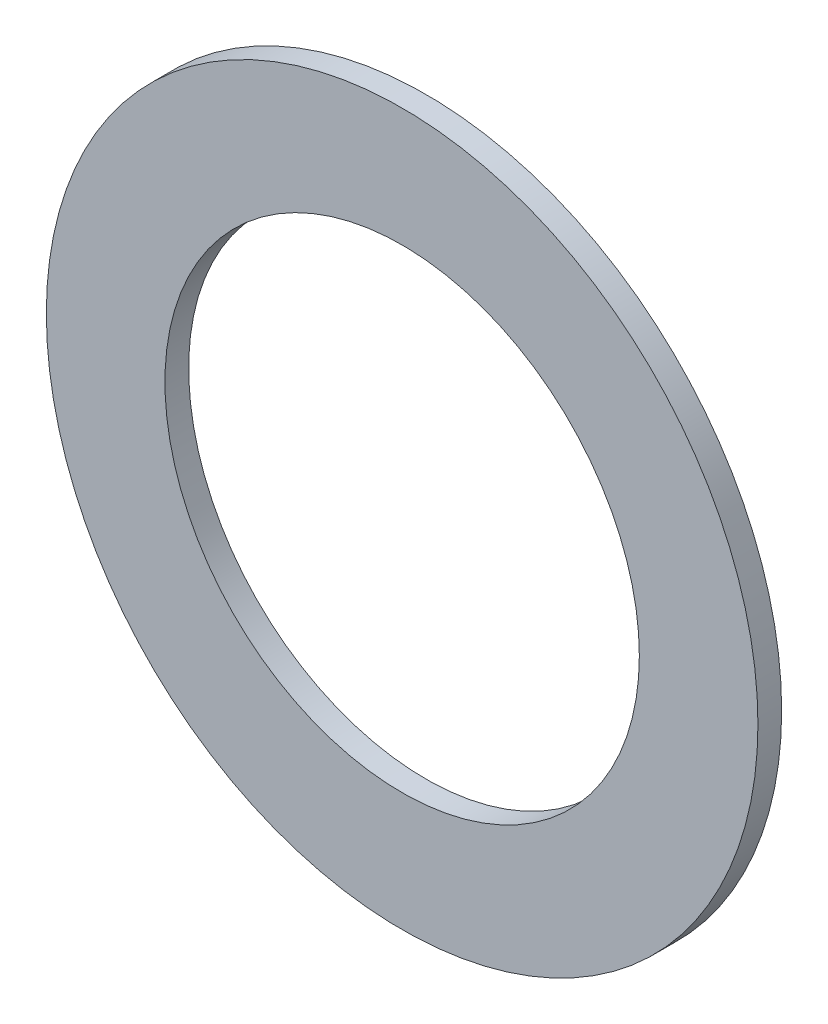
ISO-10303-21;
HEADER;
FILE_DESCRIPTION(('STEP AP214'),'2;1');
FILE_NAME('part.step','',(''),(''),'','','');
FILE_SCHEMA(('AUTOMOTIVE_DESIGN { 1 0 10303 214 1 1 1 1 }'));
ENDSEC;
DATA;
#1=APPLICATION_CONTEXT('core data for automotive mechanical design processes');
#2=APPLICATION_PROTOCOL_DEFINITION('international standard','automotive_design',2000,#1);
#3=PRODUCT_CONTEXT('',#1,'mechanical');
#4=PRODUCT('Part','Part','',(#3));
#5=PRODUCT_RELATED_PRODUCT_CATEGORY('part','',(#4));
#6=PRODUCT_DEFINITION_FORMATION('','',#4);
#7=PRODUCT_DEFINITION_CONTEXT('part definition',#1,'design');
#8=PRODUCT_DEFINITION('design','',#6,#7);
#9=PRODUCT_DEFINITION_SHAPE('','',#8);
#10=(LENGTH_UNIT() NAMED_UNIT(*) SI_UNIT(.MILLI.,.METRE.));
#11=(NAMED_UNIT(*) PLANE_ANGLE_UNIT() SI_UNIT($,.RADIAN.));
#12=(NAMED_UNIT(*) SI_UNIT($,.STERADIAN.) SOLID_ANGLE_UNIT());
#13=UNCERTAINTY_MEASURE_WITH_UNIT(LENGTH_MEASURE(1.E-05),#10,'distance_accuracy_value','');
#14=(GEOMETRIC_REPRESENTATION_CONTEXT(3) GLOBAL_UNCERTAINTY_ASSIGNED_CONTEXT((#13)) GLOBAL_UNIT_ASSIGNED_CONTEXT((#10,
#11,#12)) REPRESENTATION_CONTEXT('',''));
#15=CARTESIAN_POINT('',(0.,0.,0.));
#16=DIRECTION('',(0.,0.,1.));
#17=DIRECTION('',(1.,0.,0.));
#18=AXIS2_PLACEMENT_3D('',#15,#16,#17);
#19=CARTESIAN_POINT('',(0.,0.,0.2));
#20=DIRECTION('',(0.,0.,1.));
#21=DIRECTION('',(1.,0.,0.));
#22=AXIS2_PLACEMENT_3D('',#19,#20,#21);
#23=PLANE('',#22);
#24=CARTESIAN_POINT('',(0.,0.,0.2));
#25=DIRECTION('',(0.,0.,1.));
#26=DIRECTION('',(1.,0.,0.));
#27=AXIS2_PLACEMENT_3D('',#24,#25,#26);
#28=CIRCLE('',#27,3.);
#29=CARTESIAN_POINT('',(3.,0.,0.2));
#30=VERTEX_POINT('',#29);
#31=EDGE_CURVE('E10',#30,#30,#28,.T.);
#32=ORIENTED_EDGE('',*,*,#31,.T.);
#33=EDGE_LOOP('',(#32));
#34=FACE_BOUND('',#33,.T.);
#35=CARTESIAN_POINT('',(0.,0.,0.2));
#36=DIRECTION('',(0.,0.,1.));
#37=DIRECTION('',(1.,0.,0.));
#38=AXIS2_PLACEMENT_3D('',#35,#36,#37);
#39=CIRCLE('',#38,2.);
#40=CARTESIAN_POINT('',(2.,0.,0.2));
#41=VERTEX_POINT('',#40);
#42=EDGE_CURVE('E43',#41,#41,#39,.T.);
#43=ORIENTED_EDGE('',*,*,#42,.F.);
#44=EDGE_LOOP('',(#43));
#45=FACE_BOUND('',#44,.T.);
#46=ADVANCED_FACE('F32',(#34,#45),#23,.T.);
#47=CARTESIAN_POINT('',(0.,0.,0.));
#48=DIRECTION('',(0.,0.,1.));
#49=DIRECTION('',(1.,0.,0.));
#50=AXIS2_PLACEMENT_3D('',#47,#48,#49);
#51=PLANE('',#50);
#52=CARTESIAN_POINT('',(0.,0.,0.));
#53=DIRECTION('',(0.,0.,1.));
#54=DIRECTION('',(1.,0.,0.));
#55=AXIS2_PLACEMENT_3D('',#52,#53,#54);
#56=CIRCLE('',#55,3.);
#57=CARTESIAN_POINT('',(3.,0.,0.));
#58=VERTEX_POINT('',#57);
#59=EDGE_CURVE('E36',#58,#58,#56,.T.);
#60=ORIENTED_EDGE('',*,*,#59,.F.);
#61=EDGE_LOOP('',(#60));
#62=FACE_BOUND('',#61,.T.);
#63=CARTESIAN_POINT('',(0.,0.,0.));
#64=DIRECTION('',(0.,0.,1.));
#65=DIRECTION('',(1.,0.,0.));
#66=AXIS2_PLACEMENT_3D('',#63,#64,#65);
#67=CIRCLE('',#66,2.);
#68=CARTESIAN_POINT('',(2.,0.,0.));
#69=VERTEX_POINT('',#68);
#70=EDGE_CURVE('E45',#69,#69,#67,.T.);
#71=ORIENTED_EDGE('',*,*,#70,.T.);
#72=EDGE_LOOP('',(#71));
#73=FACE_BOUND('',#72,.T.);
#74=ADVANCED_FACE('F55',(#62,#73),#51,.F.);
#75=CARTESIAN_POINT('',(0.,0.,0.2));
#76=DIRECTION('',(0.,0.,-1.));
#77=DIRECTION('',(-1.,0.,0.));
#78=AXIS2_PLACEMENT_3D('',#75,#76,#77);
#79=CYLINDRICAL_SURFACE('',#78,3.);
#80=ORIENTED_EDGE('',*,*,#31,.F.);
#81=EDGE_LOOP('',(#80));
#82=FACE_BOUND('',#81,.T.);
#83=ORIENTED_EDGE('',*,*,#59,.T.);
#84=EDGE_LOOP('',(#83));
#85=FACE_BOUND('',#84,.T.);
#86=ADVANCED_FACE('F34',(#82,#85),#79,.T.);
#87=CARTESIAN_POINT('',(0.,0.,0.2));
#88=DIRECTION('',(0.,0.,-1.));
#89=DIRECTION('',(-1.,0.,0.));
#90=AXIS2_PLACEMENT_3D('',#87,#88,#89);
#91=CYLINDRICAL_SURFACE('',#90,2.);
#92=ORIENTED_EDGE('',*,*,#42,.T.);
#93=EDGE_LOOP('',(#92));
#94=FACE_BOUND('',#93,.T.);
#95=ORIENTED_EDGE('',*,*,#70,.F.);
#96=EDGE_LOOP('',(#95));
#97=FACE_BOUND('',#96,.T.);
#98=ADVANCED_FACE('F51',(#94,#97),#91,.F.);
#99=CLOSED_SHELL('',(#46,#74,#86,#98));
#100=MANIFOLD_SOLID_BREP('B2',#99);
#101=ADVANCED_BREP_SHAPE_REPRESENTATION('',(#18,#100),#14);
#102=SHAPE_DEFINITION_REPRESENTATION(#9,#101);
ENDSEC;
END-ISO-10303-21;
